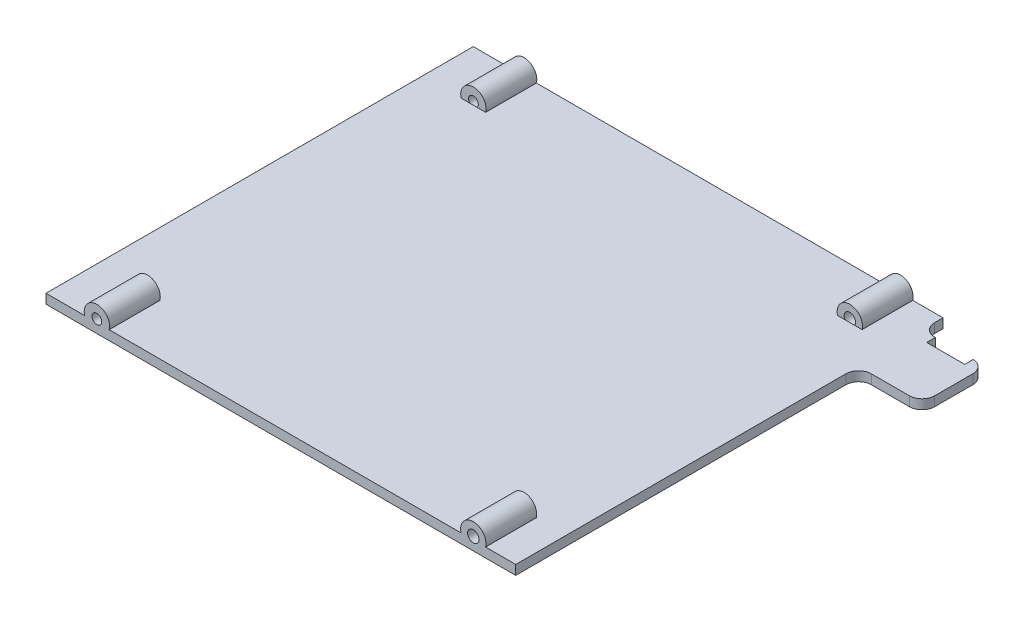
ISO-10303-21;
HEADER;
FILE_DESCRIPTION(('STEP AP214'),'2;1');
FILE_NAME('part.step','',(''),(''),'','','');
FILE_SCHEMA(('AUTOMOTIVE_DESIGN { 1 0 10303 214 1 1 1 1 }'));
ENDSEC;
DATA;
#1=APPLICATION_CONTEXT('core data for automotive mechanical design processes');
#2=APPLICATION_PROTOCOL_DEFINITION('international standard','automotive_design',2000,#1);
#3=PRODUCT_CONTEXT('',#1,'mechanical');
#4=PRODUCT('Part','Part','',(#3));
#5=PRODUCT_RELATED_PRODUCT_CATEGORY('part','',(#4));
#6=PRODUCT_DEFINITION_FORMATION('','',#4);
#7=PRODUCT_DEFINITION_CONTEXT('part definition',#1,'design');
#8=PRODUCT_DEFINITION('design','',#6,#7);
#9=PRODUCT_DEFINITION_SHAPE('','',#8);
#10=(LENGTH_UNIT() NAMED_UNIT(*) SI_UNIT(.MILLI.,.METRE.));
#11=(NAMED_UNIT(*) PLANE_ANGLE_UNIT() SI_UNIT($,.RADIAN.));
#12=(NAMED_UNIT(*) SI_UNIT($,.STERADIAN.) SOLID_ANGLE_UNIT());
#13=UNCERTAINTY_MEASURE_WITH_UNIT(LENGTH_MEASURE(1.E-05),#10,'distance_accuracy_value','');
#14=(GEOMETRIC_REPRESENTATION_CONTEXT(3) GLOBAL_UNCERTAINTY_ASSIGNED_CONTEXT((#13)) GLOBAL_UNIT_ASSIGNED_CONTEXT((#10,
#11,#12)) REPRESENTATION_CONTEXT('',''));
#15=CARTESIAN_POINT('',(0.,0.,0.));
#16=DIRECTION('',(0.,0.,1.));
#17=DIRECTION('',(1.,0.,0.));
#18=AXIS2_PLACEMENT_3D('',#15,#16,#17);
#19=CARTESIAN_POINT('',(-85.5905303741347,-18.8675075749451,-141.47256301662));
#20=DIRECTION('',(-1.,0.,0.));
#21=DIRECTION('',(0.,-1.,0.));
#22=AXIS2_PLACEMENT_3D('',#19,#20,#21);
#23=PLANE('',#22);
#24=DIRECTION('',(0.,0.999999944421006,0.000333403637407651));
#25=VECTOR('',#24,1.);
#26=CARTESIAN_POINT('',(-85.5905303741347,-20.3675075749451,-52.0805001054825));
#27=LINE('',#26,#25);
#28=CARTESIAN_POINT('',(-85.5905303741347,-20.3675075749451,-52.0805001054825));
#29=VERTEX_POINT('',#28);
#30=CARTESIAN_POINT('',(-85.5905303741347,-18.8675075749451,-52.0799999999986));
#31=VERTEX_POINT('',#30);
#32=EDGE_CURVE('E253',#29,#31,#27,.T.);
#33=ORIENTED_EDGE('',*,*,#32,.T.);
#34=DIRECTION('',(0.,0.,1.));
#35=VECTOR('',#34,1.);
#36=CARTESIAN_POINT('',(-85.5905303741347,-18.8675075749451,-141.47256301662));
#37=LINE('',#36,#35);
#38=CARTESIAN_POINT('',(-85.5905303741347,-18.8675075749451,0.));
#39=VERTEX_POINT('',#38);
#40=EDGE_CURVE('E387',#31,#39,#37,.T.);
#41=ORIENTED_EDGE('',*,*,#40,.T.);
#42=DIRECTION('',(0.,1.,0.));
#43=VECTOR('',#42,1.);
#44=CARTESIAN_POINT('',(-85.5905303741347,-18.8675075749451,0.));
#45=LINE('',#44,#43);
#46=CARTESIAN_POINT('',(-85.5905303741347,-20.3675075749451,0.));
#47=VERTEX_POINT('',#46);
#48=EDGE_CURVE('E384',#47,#39,#45,.T.);
#49=ORIENTED_EDGE('',*,*,#48,.F.);
#50=DIRECTION('',(0.,0.,1.));
#51=VECTOR('',#50,1.);
#52=CARTESIAN_POINT('',(-85.5905303741347,-20.3675075749451,-141.47256301662));
#53=LINE('',#52,#51);
#54=EDGE_CURVE('E391',#29,#47,#53,.T.);
#55=ORIENTED_EDGE('',*,*,#54,.F.);
#56=EDGE_LOOP('',(#33,#41,#49,#55));
#57=FACE_BOUND('',#56,.T.);
#58=ADVANCED_FACE('F41',(#57),#23,.F.);
#59=CARTESIAN_POINT('',(-159.667908124511,-18.8675075749451,-141.47256301662));
#60=DIRECTION('',(0.,-1.,0.));
#61=DIRECTION('',(1.,0.,0.));
#62=AXIS2_PLACEMENT_3D('',#59,#60,#61);
#63=PLANE('',#62);
#64=DIRECTION('',(1.,0.,0.));
#65=VECTOR('',#64,1.);
#66=CARTESIAN_POINT('',(-159.667908124511,-18.8675075749451,-62.7311529803631));
#67=LINE('',#66,#65);
#68=CARTESIAN_POINT('',(-83.4954652130825,-18.8675075749451,-62.7311529803631));
#69=VERTEX_POINT('',#68);
#70=CARTESIAN_POINT('',(-77.5092926086521,-18.8675075749451,-62.7311529803631));
#71=VERTEX_POINT('',#70);
#72=EDGE_CURVE('E251',#69,#71,#67,.T.);
#73=ORIENTED_EDGE('',*,*,#72,.F.);
#74=DIRECTION('',(0.,0.,1.));
#75=VECTOR('',#74,1.);
#76=CARTESIAN_POINT('',(-83.4954652130825,-18.8675075749451,-141.47256301662));
#77=LINE('',#76,#75);
#78=CARTESIAN_POINT('',(-83.4954652130825,-18.8675075749449,-64.0799999999986));
#79=VERTEX_POINT('',#78);
#80=EDGE_CURVE('E227',#79,#69,#77,.T.);
#81=ORIENTED_EDGE('',*,*,#80,.F.);
#82=DIRECTION('',(-1.,0.,0.));
#83=VECTOR('',#82,1.);
#84=CARTESIAN_POINT('',(-33.1479999999989,-18.8675075749446,-64.0799999999986));
#85=LINE('',#84,#83);
#86=CARTESIAN_POINT('',(-83.5905303741347,-18.8675075749451,-64.0799999999986));
#87=VERTEX_POINT('',#86);
#88=EDGE_CURVE('E270',#79,#87,#85,.T.);
#89=ORIENTED_EDGE('',*,*,#88,.T.);
#90=CARTESIAN_POINT('',(-83.5905303741347,-18.8675075749451,-66.0799999999986));
#91=DIRECTION('',(0.,1.,0.));
#92=DIRECTION('',(1.,0.,0.));
#93=AXIS2_PLACEMENT_3D('',#90,#91,#92);
#94=CIRCLE('',#93,2.);
#95=CARTESIAN_POINT('',(-85.5905303741347,-18.8675075749451,-66.0799999999986));
#96=VERTEX_POINT('',#95);
#97=EDGE_CURVE('E278',#96,#87,#94,.T.);
#98=ORIENTED_EDGE('',*,*,#97,.F.);
#99=CARTESIAN_POINT('',(-85.5905303741347,-18.8675075749451,-67.3799999999986));
#100=VERTEX_POINT('',#99);
#101=EDGE_CURVE('E406',#100,#96,#37,.T.);
#102=ORIENTED_EDGE('',*,*,#101,.F.);
#103=DIRECTION('',(-1.,0.,0.));
#104=VECTOR('',#103,1.);
#105=CARTESIAN_POINT('',(-159.667908124511,-18.8675075749451,-67.3799999999986));
#106=LINE('',#105,#104);
#107=CARTESIAN_POINT('',(-90.3438704257038,-18.8675075749451,-67.3799999999986));
#108=VERTEX_POINT('',#107);
#109=EDGE_CURVE('E392',#100,#108,#106,.T.);
#110=ORIENTED_EDGE('',*,*,#109,.T.);
#111=DIRECTION('',(0.,0.,-1.));
#112=VECTOR('',#111,1.);
#113=CARTESIAN_POINT('',(-90.3438704257038,-18.8675075749451,-59.3799999999986));
#114=LINE('',#113,#112);
#115=CARTESIAN_POINT('',(-90.3438704257038,-18.8675075749451,-59.3799999999986));
#116=VERTEX_POINT('',#115);
#117=EDGE_CURVE('E325',#108,#116,#114,.F.);
#118=ORIENTED_EDGE('',*,*,#117,.T.);
#119=DIRECTION('',(1.,0.,0.));
#120=VECTOR('',#119,1.);
#121=CARTESIAN_POINT('',(-159.667908124511,-18.8675075749451,-59.3799999999986));
#122=LINE('',#121,#120);
#123=CARTESIAN_POINT('',(-91.5320306214525,-18.8675075749451,-59.3799999999986));
#124=VERTEX_POINT('',#123);
#125=EDGE_CURVE('E334',#124,#116,#122,.T.);
#126=ORIENTED_EDGE('',*,*,#125,.F.);
#127=CARTESIAN_POINT('',(-93.028693576163,-18.8675075749451,-59.3799999999986));
#128=VERTEX_POINT('',#127);
#129=EDGE_CURVE('E339',#128,#124,#122,.T.);
#130=ORIENTED_EDGE('',*,*,#129,.F.);
#131=CARTESIAN_POINT('',(-94.2168537719119,-18.8675075749451,-59.3799999999986));
#132=VERTEX_POINT('',#131);
#133=EDGE_CURVE('E335',#132,#128,#122,.T.);
#134=ORIENTED_EDGE('',*,*,#133,.F.);
#135=DIRECTION('',(0.,0.,-1.));
#136=VECTOR('',#135,1.);
#137=CARTESIAN_POINT('',(-94.2168537719119,-18.8675075749451,-59.3799999999986));
#138=LINE('',#137,#136);
#139=CARTESIAN_POINT('',(-94.2168537719119,-18.8675075749451,-67.3799999999986));
#140=VERTEX_POINT('',#139);
#141=EDGE_CURVE('E317',#132,#140,#138,.T.);
#142=ORIENTED_EDGE('',*,*,#141,.T.);
#143=CARTESIAN_POINT('',(-149.708016259504,-18.8675075749451,-67.3799999999985));
#144=VERTEX_POINT('',#143);
#145=EDGE_CURVE('E396',#140,#144,#106,.T.);
#146=ORIENTED_EDGE('',*,*,#145,.T.);
#147=DIRECTION('',(0.,0.,-1.));
#148=VECTOR('',#147,1.);
#149=CARTESIAN_POINT('',(-149.708016259504,-18.8675075749451,-59.3799999999986));
#150=LINE('',#149,#148);
#151=CARTESIAN_POINT('',(-149.708016259504,-18.8675075749451,-59.3799999999986));
#152=VERTEX_POINT('',#151);
#153=EDGE_CURVE('E331',#144,#152,#150,.F.);
#154=ORIENTED_EDGE('',*,*,#153,.T.);
#155=DIRECTION('',(1.,0.,0.));
#156=VECTOR('',#155,1.);
#157=CARTESIAN_POINT('',(-159.667908124511,-18.8675075749451,-59.3799999999985));
#158=LINE('',#157,#156);
#159=CARTESIAN_POINT('',(-151.059398233736,-18.8675075749451,-59.3799999999986));
#160=VERTEX_POINT('',#159);
#161=EDGE_CURVE('E338',#160,#152,#158,.T.);
#162=ORIENTED_EDGE('',*,*,#161,.F.);
#163=CARTESIAN_POINT('',(-152.22961763148,-18.8675075749451,-59.3799999999986));
#164=VERTEX_POINT('',#163);
#165=EDGE_CURVE('E344',#164,#160,#158,.T.);
#166=ORIENTED_EDGE('',*,*,#165,.F.);
#167=CARTESIAN_POINT('',(-153.580999605713,-18.8675075749451,-59.3799999999986));
#168=VERTEX_POINT('',#167);
#169=EDGE_CURVE('E340',#168,#164,#158,.T.);
#170=ORIENTED_EDGE('',*,*,#169,.F.);
#171=DIRECTION('',(0.,0.,-1.));
#172=VECTOR('',#171,1.);
#173=CARTESIAN_POINT('',(-153.580999605713,-18.8675075749451,-59.3799999999986));
#174=LINE('',#173,#172);
#175=CARTESIAN_POINT('',(-153.580999605713,-18.8675075749451,-67.3799999999986));
#176=VERTEX_POINT('',#175);
#177=EDGE_CURVE('E328',#168,#176,#174,.T.);
#178=ORIENTED_EDGE('',*,*,#177,.T.);
#179=CARTESIAN_POINT('',(-159.667908124511,-18.8675075749451,-67.3799999999986));
#180=VERTEX_POINT('',#179);
#181=EDGE_CURVE('E397',#176,#180,#106,.T.);
#182=ORIENTED_EDGE('',*,*,#181,.T.);
#183=DIRECTION('',(0.,0.,1.));
#184=VECTOR('',#183,1.);
#185=CARTESIAN_POINT('',(-159.667908124511,-18.8675075749451,-141.47256301662));
#186=LINE('',#185,#184);
#187=CARTESIAN_POINT('',(-159.667908124511,-18.8675075749451,0.));
#188=VERTEX_POINT('',#187);
#189=EDGE_CURVE('E378',#180,#188,#186,.T.);
#190=ORIENTED_EDGE('',*,*,#189,.T.);
#191=DIRECTION('',(-1.,0.,0.));
#192=VECTOR('',#191,1.);
#193=CARTESIAN_POINT('',(-159.667908124511,-18.8675075749451,0.));
#194=LINE('',#193,#192);
#195=CARTESIAN_POINT('',(-153.580999605712,-18.8675075749451,0.));
#196=VERTEX_POINT('',#195);
#197=EDGE_CURVE('E383',#196,#188,#194,.T.);
#198=ORIENTED_EDGE('',*,*,#197,.F.);
#199=DIRECTION('',(0.,0.,1.));
#200=VECTOR('',#199,1.);
#201=CARTESIAN_POINT('',(-153.580999605712,-18.8675075749451,-8.));
#202=LINE('',#201,#200);
#203=CARTESIAN_POINT('',(-153.580999605712,-18.8675075749451,-8.));
#204=VERTEX_POINT('',#203);
#205=EDGE_CURVE('E371',#196,#204,#202,.F.);
#206=ORIENTED_EDGE('',*,*,#205,.T.);
#207=DIRECTION('',(-1.,0.,0.));
#208=VECTOR('',#207,1.);
#209=CARTESIAN_POINT('',(-159.667908124511,-18.8675075749451,-8.00000000000001));
#210=LINE('',#209,#208);
#211=CARTESIAN_POINT('',(-152.22961763148,-18.8675075749451,-8.));
#212=VERTEX_POINT('',#211);
#213=EDGE_CURVE('E416',#212,#204,#210,.T.);
#214=ORIENTED_EDGE('',*,*,#213,.F.);
#215=CARTESIAN_POINT('',(-151.059398233736,-18.8675075749451,-8.));
#216=VERTEX_POINT('',#215);
#217=EDGE_CURVE('E422',#216,#212,#210,.T.);
#218=ORIENTED_EDGE('',*,*,#217,.F.);
#219=CARTESIAN_POINT('',(-149.708016259504,-18.8675075749451,-8.));
#220=VERTEX_POINT('',#219);
#221=EDGE_CURVE('E418',#220,#216,#210,.T.);
#222=ORIENTED_EDGE('',*,*,#221,.F.);
#223=DIRECTION('',(0.,0.,1.));
#224=VECTOR('',#223,1.);
#225=CARTESIAN_POINT('',(-149.708016259504,-18.8675075749451,-8.));
#226=LINE('',#225,#224);
#227=CARTESIAN_POINT('',(-149.708016259504,-18.8675075749451,0.));
#228=VERTEX_POINT('',#227);
#229=EDGE_CURVE('E368',#220,#228,#226,.T.);
#230=ORIENTED_EDGE('',*,*,#229,.T.);
#231=CARTESIAN_POINT('',(-94.2168537719112,-18.8675075749451,0.));
#232=VERTEX_POINT('',#231);
#233=EDGE_CURVE('E382',#232,#228,#194,.T.);
#234=ORIENTED_EDGE('',*,*,#233,.F.);
#235=DIRECTION('',(0.,0.,1.));
#236=VECTOR('',#235,1.);
#237=CARTESIAN_POINT('',(-94.2168537719112,-18.8675075749451,-8.));
#238=LINE('',#237,#236);
#239=CARTESIAN_POINT('',(-94.2168537719112,-18.8675075749451,-8.));
#240=VERTEX_POINT('',#239);
#241=EDGE_CURVE('E365',#232,#240,#238,.F.);
#242=ORIENTED_EDGE('',*,*,#241,.T.);
#243=DIRECTION('',(-1.,0.,0.));
#244=VECTOR('',#243,1.);
#245=CARTESIAN_POINT('',(-159.667908124511,-18.8675075749451,-8.00000000000001));
#246=LINE('',#245,#244);
#247=CARTESIAN_POINT('',(-93.0286935761624,-18.8675075749451,-8.));
#248=VERTEX_POINT('',#247);
#249=EDGE_CURVE('E395',#248,#240,#246,.T.);
#250=ORIENTED_EDGE('',*,*,#249,.F.);
#251=CARTESIAN_POINT('',(-91.5320306214526,-18.8675075749451,-8.));
#252=VERTEX_POINT('',#251);
#253=EDGE_CURVE('E417',#252,#248,#246,.T.);
#254=ORIENTED_EDGE('',*,*,#253,.F.);
#255=CARTESIAN_POINT('',(-90.3438704257039,-18.8675075749451,-8.));
#256=VERTEX_POINT('',#255);
#257=EDGE_CURVE('E413',#256,#252,#246,.T.);
#258=ORIENTED_EDGE('',*,*,#257,.F.);
#259=DIRECTION('',(0.,0.,1.));
#260=VECTOR('',#259,1.);
#261=CARTESIAN_POINT('',(-90.3438704257039,-18.8675075749451,-8.));
#262=LINE('',#261,#260);
#263=CARTESIAN_POINT('',(-90.3438704257039,-18.8675075749451,0.));
#264=VERTEX_POINT('',#263);
#265=EDGE_CURVE('E357',#256,#264,#262,.T.);
#266=ORIENTED_EDGE('',*,*,#265,.T.);
#267=EDGE_CURVE('E379',#39,#264,#194,.T.);
#268=ORIENTED_EDGE('',*,*,#267,.F.);
#269=ORIENTED_EDGE('',*,*,#40,.F.);
#270=CARTESIAN_POINT('',(-83.5905303741347,-18.8675075749451,-52.0799999999986));
#271=DIRECTION('',(0.,1.,0.));
#272=DIRECTION('',(1.,0.,0.));
#273=AXIS2_PLACEMENT_3D('',#270,#271,#272);
#274=CIRCLE('',#273,2.);
#275=CARTESIAN_POINT('',(-83.5905303741347,-18.8675075749451,-54.0799999999986));
#276=VERTEX_POINT('',#275);
#277=EDGE_CURVE('E63',#276,#31,#274,.T.);
#278=ORIENTED_EDGE('',*,*,#277,.F.);
#279=DIRECTION('',(1.,0.,0.));
#280=VECTOR('',#279,1.);
#281=CARTESIAN_POINT('',(-33.1479999999989,-18.8675075749446,-54.0799999999986));
#282=LINE('',#281,#280);
#283=CARTESIAN_POINT('',(-77.5905303741347,-18.867507574945,-54.0799999999986));
#284=VERTEX_POINT('',#283);
#285=EDGE_CURVE('E258',#276,#284,#282,.T.);
#286=ORIENTED_EDGE('',*,*,#285,.T.);
#287=CARTESIAN_POINT('',(-77.5905303741347,-18.867507574945,-56.0799999999986));
#288=DIRECTION('',(0.,1.,0.));
#289=DIRECTION('',(1.,0.,0.));
#290=AXIS2_PLACEMENT_3D('',#287,#288,#289);
#291=CIRCLE('',#290,2.);
#292=CARTESIAN_POINT('',(-75.5905303741347,-18.867507574945,-56.0799999999986));
#293=VERTEX_POINT('',#292);
#294=EDGE_CURVE('E261',#284,#293,#291,.T.);
#295=ORIENTED_EDGE('',*,*,#294,.T.);
#296=DIRECTION('',(0.,0.,-1.));
#297=VECTOR('',#296,1.);
#298=CARTESIAN_POINT('',(-75.5905303741347,-18.867507574945,-52.0799999999985));
#299=LINE('',#298,#297);
#300=CARTESIAN_POINT('',(-75.5905303741347,-18.867507574945,-62.0799999999986));
#301=VERTEX_POINT('',#300);
#302=EDGE_CURVE('E264',#293,#301,#299,.T.);
#303=ORIENTED_EDGE('',*,*,#302,.T.);
#304=CARTESIAN_POINT('',(-77.5905303741347,-18.867507574945,-62.0799999999986));
#305=DIRECTION('',(0.,1.,0.));
#306=DIRECTION('',(1.,0.,0.));
#307=AXIS2_PLACEMENT_3D('',#304,#305,#306);
#308=CIRCLE('',#307,2.);
#309=CARTESIAN_POINT('',(-77.5092926086521,-18.8675075749449,-64.0783494252642));
#310=VERTEX_POINT('',#309);
#311=EDGE_CURVE('E267',#301,#310,#308,.T.);
#312=ORIENTED_EDGE('',*,*,#311,.T.);
#313=DIRECTION('',(0.,0.,-1.));
#314=VECTOR('',#313,1.);
#315=CARTESIAN_POINT('',(-77.5092926086521,-18.8675075749451,-141.47256301662));
#316=LINE('',#315,#314);
#317=EDGE_CURVE('E247',#71,#310,#316,.T.);
#318=ORIENTED_EDGE('',*,*,#317,.F.);
#319=EDGE_LOOP('',(#73,#81,#89,#98,#102,#110,#118,#126,#130,#134,#142,#146,#154,#162,#166,#170,
#178,#182,#190,#198,#206,#214,#218,#222,#230,#234,#242,#250,#254,#258,#266,#268,#269,#278,#286,
#295,#303,#312,#318));
#320=FACE_BOUND('',#319,.T.);
#321=ADVANCED_FACE('F440',(#320),#63,.F.);
#322=CARTESIAN_POINT('',(-85.5905303741347,-20.3675075749451,-141.47256301662));
#323=DIRECTION('',(0.,1.,0.));
#324=DIRECTION('',(-1.,0.,0.));
#325=AXIS2_PLACEMENT_3D('',#322,#323,#324);
#326=PLANE('',#325);
#327=CARTESIAN_POINT('',(-77.5905303741347,-20.3675075749451,-62.0799999999986));
#328=DIRECTION('',(0.,-1.,0.));
#329=DIRECTION('',(-1.,0.,0.));
#330=AXIS2_PLACEMENT_3D('',#327,#328,#329);
#331=CIRCLE('',#330,2.);
#332=CARTESIAN_POINT('',(-77.5092926086521,-20.3675075749451,-64.0783494252642));
#333=VERTEX_POINT('',#332);
#334=CARTESIAN_POINT('',(-75.5905303741347,-20.3675075749451,-62.0799999999986));
#335=VERTEX_POINT('',#334);
#336=EDGE_CURVE('E284',#333,#335,#331,.T.);
#337=ORIENTED_EDGE('',*,*,#336,.T.);
#338=DIRECTION('',(0.,0.,1.));
#339=VECTOR('',#338,1.);
#340=CARTESIAN_POINT('',(-75.5905303741347,-20.3675075749451,-64.0799999999986));
#341=LINE('',#340,#339);
#342=CARTESIAN_POINT('',(-75.5905303741347,-20.3675075749451,-56.0799999999986));
#343=VERTEX_POINT('',#342);
#344=EDGE_CURVE('E286',#335,#343,#341,.T.);
#345=ORIENTED_EDGE('',*,*,#344,.T.);
#346=CARTESIAN_POINT('',(-77.5905303741347,-20.3675075749451,-56.0799999999986));
#347=DIRECTION('',(0.,-1.,0.));
#348=DIRECTION('',(-1.,0.,0.));
#349=AXIS2_PLACEMENT_3D('',#346,#347,#348);
#350=CIRCLE('',#349,2.);
#351=CARTESIAN_POINT('',(-77.5905303741347,-20.3675075749451,-54.0799999999986));
#352=VERTEX_POINT('',#351);
#353=EDGE_CURVE('E273',#343,#352,#350,.T.);
#354=ORIENTED_EDGE('',*,*,#353,.T.);
#355=DIRECTION('',(-1.,0.,0.));
#356=VECTOR('',#355,1.);
#357=CARTESIAN_POINT('',(-75.5905303741347,-20.3675075749451,-54.0799999999986));
#358=LINE('',#357,#356);
#359=CARTESIAN_POINT('',(-83.5905303741347,-20.3675075749451,-54.0799999999986));
#360=VERTEX_POINT('',#359);
#361=EDGE_CURVE('E277',#352,#360,#358,.T.);
#362=ORIENTED_EDGE('',*,*,#361,.T.);
#363=CARTESIAN_POINT('',(-83.5905303741347,-20.3675075749451,-52.0799999999986));
#364=DIRECTION('',(0.,-1.,0.));
#365=DIRECTION('',(-1.,0.,0.));
#366=AXIS2_PLACEMENT_3D('',#363,#364,#365);
#367=CIRCLE('',#366,2.);
#368=EDGE_CURVE('E274',#29,#360,#367,.T.);
#369=ORIENTED_EDGE('',*,*,#368,.F.);
#370=ORIENTED_EDGE('',*,*,#54,.T.);
#371=DIRECTION('',(1.,0.,0.));
#372=VECTOR('',#371,1.);
#373=CARTESIAN_POINT('',(-85.5905303741347,-20.3675075749451,0.));
#374=LINE('',#373,#372);
#375=CARTESIAN_POINT('',(-159.667908124511,-20.3675075749451,0.));
#376=VERTEX_POINT('',#375);
#377=EDGE_CURVE('E389',#376,#47,#374,.T.);
#378=ORIENTED_EDGE('',*,*,#377,.F.);
#379=DIRECTION('',(0.,0.,1.));
#380=VECTOR('',#379,1.);
#381=CARTESIAN_POINT('',(-159.667908124511,-20.3675075749451,-141.47256301662));
#382=LINE('',#381,#380);
#383=CARTESIAN_POINT('',(-159.667908124511,-20.3675075749451,-67.3799999999986));
#384=VERTEX_POINT('',#383);
#385=EDGE_CURVE('E374',#384,#376,#382,.T.);
#386=ORIENTED_EDGE('',*,*,#385,.F.);
#387=DIRECTION('',(1.,0.,0.));
#388=VECTOR('',#387,1.);
#389=CARTESIAN_POINT('',(-85.5905303741347,-20.3675075749451,-67.3799999999986));
#390=LINE('',#389,#388);
#391=CARTESIAN_POINT('',(-85.5905303741347,-20.3675075749451,-67.3799999999986));
#392=VERTEX_POINT('',#391);
#393=EDGE_CURVE('E400',#384,#392,#390,.T.);
#394=ORIENTED_EDGE('',*,*,#393,.T.);
#395=CARTESIAN_POINT('',(-85.5905303741347,-20.3675075749451,-66.0799999999986));
#396=VERTEX_POINT('',#395);
#397=EDGE_CURVE('E388',#392,#396,#53,.T.);
#398=ORIENTED_EDGE('',*,*,#397,.T.);
#399=CARTESIAN_POINT('',(-83.5905303741347,-20.3675075749451,-66.0799999999986));
#400=DIRECTION('',(0.,-1.,0.));
#401=DIRECTION('',(-1.,0.,0.));
#402=AXIS2_PLACEMENT_3D('',#399,#400,#401);
#403=CIRCLE('',#402,2.);
#404=CARTESIAN_POINT('',(-83.5905303741347,-20.3675075749451,-64.0799999999986));
#405=VERTEX_POINT('',#404);
#406=EDGE_CURVE('E281',#396,#405,#403,.F.);
#407=ORIENTED_EDGE('',*,*,#406,.T.);
#408=DIRECTION('',(1.,0.,0.));
#409=VECTOR('',#408,1.);
#410=CARTESIAN_POINT('',(-85.5905303741346,-20.3675075749451,-64.0799999999986));
#411=LINE('',#410,#409);
#412=CARTESIAN_POINT('',(-83.4954652130825,-20.3675075749454,-64.0799999999986));
#413=VERTEX_POINT('',#412);
#414=EDGE_CURVE('E243',#405,#413,#411,.T.);
#415=ORIENTED_EDGE('',*,*,#414,.T.);
#416=DIRECTION('',(0.,0.,1.));
#417=VECTOR('',#416,1.);
#418=CARTESIAN_POINT('',(-83.4954652130825,-20.3675075749454,-66.6522392252637));
#419=LINE('',#418,#417);
#420=CARTESIAN_POINT('',(-83.4954652130825,-20.3675075749454,-62.7311529803631));
#421=VERTEX_POINT('',#420);
#422=EDGE_CURVE('E224',#413,#421,#419,.T.);
#423=ORIENTED_EDGE('',*,*,#422,.T.);
#424=DIRECTION('',(1.,0.,0.));
#425=VECTOR('',#424,1.);
#426=CARTESIAN_POINT('',(-83.4954652130825,-20.3675075749454,-62.7311529803631));
#427=LINE('',#426,#425);
#428=CARTESIAN_POINT('',(-77.5092926086521,-20.3675075749454,-62.7311529803631));
#429=VERTEX_POINT('',#428);
#430=EDGE_CURVE('E235',#421,#429,#427,.T.);
#431=ORIENTED_EDGE('',*,*,#430,.T.);
#432=DIRECTION('',(0.,0.,-1.));
#433=VECTOR('',#432,1.);
#434=CARTESIAN_POINT('',(-77.5092926086521,-20.3675075749454,-62.7311529803631));
#435=LINE('',#434,#433);
#436=EDGE_CURVE('E232',#429,#333,#435,.T.);
#437=ORIENTED_EDGE('',*,*,#436,.T.);
#438=EDGE_LOOP('',(#337,#345,#354,#362,#369,#370,#378,#386,#394,#398,#407,#415,#423,#431,#437));
#439=FACE_BOUND('',#438,.T.);
#440=ADVANCED_FACE('F240',(#439),#326,.F.);
#441=ORIENTED_EDGE('',*,*,#397,.F.);
#442=DIRECTION('',(0.,1.,0.));
#443=VECTOR('',#442,1.);
#444=CARTESIAN_POINT('',(-85.5905303741347,-18.867507574945,-67.3799999999986));
#445=LINE('',#444,#443);
#446=EDGE_CURVE('E398',#392,#100,#445,.T.);
#447=ORIENTED_EDGE('',*,*,#446,.T.);
#448=ORIENTED_EDGE('',*,*,#101,.T.);
#449=DIRECTION('',(0.,1.,0.));
#450=VECTOR('',#449,1.);
#451=CARTESIAN_POINT('',(-85.5905303741347,19.6324924250548,-66.0799999999986));
#452=LINE('',#451,#450);
#453=EDGE_CURVE('E257',#96,#396,#452,.F.);
#454=ORIENTED_EDGE('',*,*,#453,.T.);
#455=EDGE_LOOP('',(#441,#447,#448,#454));
#456=FACE_BOUND('',#455,.T.);
#457=ADVANCED_FACE('F475',(#456),#23,.F.);
#458=CARTESIAN_POINT('',(-159.667908124511,-20.3675075749451,-141.47256301662));
#459=DIRECTION('',(1.,0.,0.));
#460=DIRECTION('',(0.,0.,1.));
#461=AXIS2_PLACEMENT_3D('',#458,#459,#460);
#462=PLANE('',#461);
#463=DIRECTION('',(0.,-1.,0.));
#464=VECTOR('',#463,1.);
#465=CARTESIAN_POINT('',(-159.667908124511,-20.367507574945,-67.3799999999986));
#466=LINE('',#465,#464);
#467=EDGE_CURVE('E377',#180,#384,#466,.T.);
#468=ORIENTED_EDGE('',*,*,#467,.T.);
#469=ORIENTED_EDGE('',*,*,#385,.T.);
#470=DIRECTION('',(0.,-1.,0.));
#471=VECTOR('',#470,1.);
#472=CARTESIAN_POINT('',(-159.667908124511,-20.3675075749451,0.));
#473=LINE('',#472,#471);
#474=EDGE_CURVE('E375',#188,#376,#473,.T.);
#475=ORIENTED_EDGE('',*,*,#474,.F.);
#476=ORIENTED_EDGE('',*,*,#189,.F.);
#477=EDGE_LOOP('',(#468,#469,#475,#476));
#478=FACE_BOUND('',#477,.T.);
#479=ADVANCED_FACE('F466',(#478),#462,.F.);
#480=CARTESIAN_POINT('',(0.,0.,0.));
#481=DIRECTION('',(0.,0.,1.));
#482=DIRECTION('',(-1.,0.,0.));
#483=AXIS2_PLACEMENT_3D('',#480,#481,#482);
#484=PLANE('',#483);
#485=CARTESIAN_POINT('',(-151.644507932608,-18.3675075749456,0.));
#486=DIRECTION('',(0.,0.,-1.));
#487=DIRECTION('',(-1.,0.,0.));
#488=AXIS2_PLACEMENT_3D('',#485,#486,#487);
#489=CIRCLE('',#488,0.769644956920995);
#490=CARTESIAN_POINT('',(-152.414152889529,-18.3675075749456,0.));
#491=VERTEX_POINT('',#490);
#492=EDGE_CURVE('E345',#491,#491,#489,.T.);
#493=ORIENTED_EDGE('',*,*,#492,.T.);
#494=EDGE_LOOP('',(#493));
#495=FACE_BOUND('',#494,.T.);
#496=CARTESIAN_POINT('',(-92.2803620988075,-18.3675075749452,0.));
#497=DIRECTION('',(0.,0.,-1.));
#498=DIRECTION('',(-1.,0.,0.));
#499=AXIS2_PLACEMENT_3D('',#496,#497,#498);
#500=CIRCLE('',#499,0.900000000000003);
#501=CARTESIAN_POINT('',(-93.1803620988075,-18.3675075749452,0.));
#502=VERTEX_POINT('',#501);
#503=EDGE_CURVE('E349',#502,#502,#500,.T.);
#504=ORIENTED_EDGE('',*,*,#503,.T.);
#505=EDGE_LOOP('',(#504));
#506=FACE_BOUND('',#505,.T.);
#507=ORIENTED_EDGE('',*,*,#48,.T.);
#508=ORIENTED_EDGE('',*,*,#267,.T.);
#509=CARTESIAN_POINT('',(-92.2803620988075,-18.3675075749452,0.));
#510=DIRECTION('',(0.,0.,1.));
#511=DIRECTION('',(1.,0.,0.));
#512=AXIS2_PLACEMENT_3D('',#509,#510,#511);
#513=CIRCLE('',#512,1.99999999999992);
#514=EDGE_CURVE('E360',#264,#232,#513,.T.);
#515=ORIENTED_EDGE('',*,*,#514,.T.);
#516=ORIENTED_EDGE('',*,*,#233,.T.);
#517=CARTESIAN_POINT('',(-151.644507932608,-18.3675075749453,0.));
#518=DIRECTION('',(0.,0.,1.));
#519=DIRECTION('',(1.,0.,0.));
#520=AXIS2_PLACEMENT_3D('',#517,#518,#519);
#521=CIRCLE('',#520,2.00000000000008);
#522=EDGE_CURVE('E358',#228,#196,#521,.T.);
#523=ORIENTED_EDGE('',*,*,#522,.T.);
#524=ORIENTED_EDGE('',*,*,#197,.T.);
#525=ORIENTED_EDGE('',*,*,#474,.T.);
#526=ORIENTED_EDGE('',*,*,#377,.T.);
#527=EDGE_LOOP('',(#507,#508,#515,#516,#523,#524,#525,#526));
#528=FACE_BOUND('',#527,.T.);
#529=ADVANCED_FACE('F461',(#495,#506,#528),#484,.T.);
#530=CARTESIAN_POINT('',(-53.1500000000001,-0.367507574945579,-67.3799999999986));
#531=DIRECTION('',(0.,0.,-1.));
#532=DIRECTION('',(0.999885624174656,-0.015124105555629,0.));
#533=AXIS2_PLACEMENT_3D('',#530,#531,#532);
#534=PLANE('',#533);
#535=CARTESIAN_POINT('',(-92.2803620988078,-18.3675075749455,-67.3799999999986));
#536=DIRECTION('',(0.,0.,-1.));
#537=DIRECTION('',(0.,1.,0.));
#538=AXIS2_PLACEMENT_3D('',#535,#536,#537);
#539=CIRCLE('',#538,0.900000000000158);
#540=CARTESIAN_POINT('',(-92.2803620988078,-17.4675075749454,-67.3799999999986));
#541=VERTEX_POINT('',#540);
#542=EDGE_CURVE('E305',#541,#541,#539,.T.);
#543=ORIENTED_EDGE('',*,*,#542,.F.);
#544=EDGE_LOOP('',(#543));
#545=FACE_BOUND('',#544,.T.);
#546=CARTESIAN_POINT('',(-151.644507932608,-18.3675075749455,-67.3799999999985));
#547=DIRECTION('',(0.,0.,-1.));
#548=DIRECTION('',(0.,1.,0.));
#549=AXIS2_PLACEMENT_3D('',#546,#547,#548);
#550=CIRCLE('',#549,0.769644956920995);
#551=CARTESIAN_POINT('',(-151.644507932608,-17.5978626180245,-67.3799999999985));
#552=VERTEX_POINT('',#551);
#553=EDGE_CURVE('E293',#552,#552,#550,.T.);
#554=ORIENTED_EDGE('',*,*,#553,.F.);
#555=EDGE_LOOP('',(#554));
#556=FACE_BOUND('',#555,.T.);
#557=ORIENTED_EDGE('',*,*,#109,.F.);
#558=ORIENTED_EDGE('',*,*,#446,.F.);
#559=ORIENTED_EDGE('',*,*,#393,.F.);
#560=ORIENTED_EDGE('',*,*,#467,.F.);
#561=ORIENTED_EDGE('',*,*,#181,.F.);
#562=CARTESIAN_POINT('',(-151.644507932608,-18.3675075749456,-67.3799999999985));
#563=DIRECTION('',(0.,0.,-1.));
#564=DIRECTION('',(0.,1.,0.));
#565=AXIS2_PLACEMENT_3D('',#562,#563,#564);
#566=CIRCLE('',#565,2.00000000000039);
#567=EDGE_CURVE('E318',#176,#144,#566,.T.);
#568=ORIENTED_EDGE('',*,*,#567,.T.);
#569=ORIENTED_EDGE('',*,*,#145,.F.);
#570=CARTESIAN_POINT('',(-92.2803620988079,-18.3675075749456,-67.3799999999986));
#571=DIRECTION('',(0.,0.,-1.));
#572=DIRECTION('',(0.,1.,0.));
#573=AXIS2_PLACEMENT_3D('',#570,#571,#572);
#574=CIRCLE('',#573,2.00000000000021);
#575=EDGE_CURVE('E320',#140,#108,#574,.T.);
#576=ORIENTED_EDGE('',*,*,#575,.T.);
#577=EDGE_LOOP('',(#557,#558,#559,#560,#561,#568,#569,#576));
#578=FACE_BOUND('',#577,.T.);
#579=ADVANCED_FACE('F43',(#545,#556,#578),#534,.T.);
#580=CARTESIAN_POINT('',(-92.2803620988075,-18.3675075749452,-8.));
#581=DIRECTION('',(0.,0.,-1.));
#582=DIRECTION('',(1.,0.,0.));
#583=AXIS2_PLACEMENT_3D('',#580,#581,#582);
#584=PLANE('',#583);
#585=CARTESIAN_POINT('',(-92.2803620988075,-18.3675075749452,-8.));
#586=DIRECTION('',(0.,0.,1.));
#587=DIRECTION('',(1.,0.,0.));
#588=AXIS2_PLACEMENT_3D('',#585,#586,#587);
#589=CIRCLE('',#588,0.900000000000003);
#590=EDGE_CURVE('E425',#252,#248,#589,.T.);
#591=ORIENTED_EDGE('',*,*,#590,.T.);
#592=ORIENTED_EDGE('',*,*,#249,.T.);
#593=CARTESIAN_POINT('',(-92.2803620988075,-18.3675075749452,-8.));
#594=DIRECTION('',(0.,0.,1.));
#595=DIRECTION('',(1.,0.,0.));
#596=AXIS2_PLACEMENT_3D('',#593,#594,#595);
#597=CIRCLE('',#596,1.99999999999992);
#598=EDGE_CURVE('E351',#256,#240,#597,.T.);
#599=ORIENTED_EDGE('',*,*,#598,.F.);
#600=ORIENTED_EDGE('',*,*,#257,.T.);
#601=EDGE_LOOP('',(#591,#592,#599,#600));
#602=FACE_BOUND('',#601,.T.);
#603=ADVANCED_FACE('F717',(#602),#584,.T.);
#604=CARTESIAN_POINT('',(-92.2803620988075,-18.3675075749452,-8.));
#605=DIRECTION('',(0.,0.,1.));
#606=DIRECTION('',(-1.,0.,0.));
#607=AXIS2_PLACEMENT_3D('',#604,#605,#606);
#608=CYLINDRICAL_SURFACE('',#607,1.99999999999992);
#609=ORIENTED_EDGE('',*,*,#514,.F.);
#610=ORIENTED_EDGE('',*,*,#265,.F.);
#611=ORIENTED_EDGE('',*,*,#598,.T.);
#612=ORIENTED_EDGE('',*,*,#241,.F.);
#613=EDGE_LOOP('',(#609,#610,#611,#612));
#614=FACE_BOUND('',#613,.T.);
#615=ADVANCED_FACE('F708',(#614),#608,.T.);
#616=CARTESIAN_POINT('',(-151.644507932608,-18.3675075749453,-8.));
#617=DIRECTION('',(0.,0.,-1.));
#618=DIRECTION('',(1.,0.,0.));
#619=AXIS2_PLACEMENT_3D('',#616,#617,#618);
#620=PLANE('',#619);
#621=CARTESIAN_POINT('',(-151.644507932608,-18.3675075749456,-8.));
#622=DIRECTION('',(0.,0.,1.));
#623=DIRECTION('',(1.,0.,0.));
#624=AXIS2_PLACEMENT_3D('',#621,#622,#623);
#625=CIRCLE('',#624,0.769644956920995);
#626=EDGE_CURVE('E421',#216,#212,#625,.T.);
#627=ORIENTED_EDGE('',*,*,#626,.T.);
#628=ORIENTED_EDGE('',*,*,#213,.T.);
#629=CARTESIAN_POINT('',(-151.644507932608,-18.3675075749453,-8.));
#630=DIRECTION('',(0.,0.,1.));
#631=DIRECTION('',(1.,0.,0.));
#632=AXIS2_PLACEMENT_3D('',#629,#630,#631);
#633=CIRCLE('',#632,2.00000000000008);
#634=EDGE_CURVE('E355',#220,#204,#633,.T.);
#635=ORIENTED_EDGE('',*,*,#634,.F.);
#636=ORIENTED_EDGE('',*,*,#221,.T.);
#637=EDGE_LOOP('',(#627,#628,#635,#636));
#638=FACE_BOUND('',#637,.T.);
#639=ADVANCED_FACE('F586',(#638),#620,.T.);
#640=CARTESIAN_POINT('',(-151.644507932608,-18.3675075749453,-8.));
#641=DIRECTION('',(0.,0.,1.));
#642=DIRECTION('',(-1.,0.,0.));
#643=AXIS2_PLACEMENT_3D('',#640,#641,#642);
#644=CYLINDRICAL_SURFACE('',#643,2.00000000000008);
#645=ORIENTED_EDGE('',*,*,#522,.F.);
#646=ORIENTED_EDGE('',*,*,#229,.F.);
#647=ORIENTED_EDGE('',*,*,#634,.T.);
#648=ORIENTED_EDGE('',*,*,#205,.F.);
#649=EDGE_LOOP('',(#645,#646,#647,#648));
#650=FACE_BOUND('',#649,.T.);
#651=ADVANCED_FACE('F567',(#650),#644,.T.);
#652=CARTESIAN_POINT('',(-92.2803620988075,-18.3675075749452,-8.));
#653=DIRECTION('',(0.,0.,-1.));
#654=DIRECTION('',(1.,0.,0.));
#655=AXIS2_PLACEMENT_3D('',#652,#653,#654);
#656=PLANE('',#655);
#657=CARTESIAN_POINT('',(-151.644507932608,-18.3675075749456,-8.));
#658=DIRECTION('',(0.,0.,1.));
#659=DIRECTION('',(1.,0.,0.));
#660=AXIS2_PLACEMENT_3D('',#657,#658,#659);
#661=CIRCLE('',#660,0.769644956920995);
#662=EDGE_CURVE('E348',#216,#212,#661,.F.);
#663=ORIENTED_EDGE('',*,*,#662,.F.);
#664=ORIENTED_EDGE('',*,*,#217,.T.);
#665=EDGE_LOOP('',(#663,#664));
#666=FACE_BOUND('',#665,.T.);
#667=ADVANCED_FACE('F561',(#666),#656,.F.);
#668=CARTESIAN_POINT('',(-151.644507932608,-18.3675075749456,-10.5455844122716));
#669=DIRECTION('',(0.,0.,1.));
#670=DIRECTION('',(-1.,0.,0.));
#671=AXIS2_PLACEMENT_3D('',#668,#669,#670);
#672=CYLINDRICAL_SURFACE('',#671,0.769644956920995);
#673=ORIENTED_EDGE('',*,*,#492,.F.);
#674=EDGE_LOOP('',(#673));
#675=FACE_BOUND('',#674,.T.);
#676=ORIENTED_EDGE('',*,*,#662,.T.);
#677=ORIENTED_EDGE('',*,*,#626,.F.);
#678=EDGE_LOOP('',(#676,#677));
#679=FACE_BOUND('',#678,.T.);
#680=ADVANCED_FACE('F566',(#675,#679),#672,.F.);
#681=CARTESIAN_POINT('',(-92.2803620988075,-18.3675075749452,-8.));
#682=DIRECTION('',(0.,0.,-1.));
#683=DIRECTION('',(1.,0.,0.));
#684=AXIS2_PLACEMENT_3D('',#681,#682,#683);
#685=PLANE('',#684);
#686=CARTESIAN_POINT('',(-92.2803620988075,-18.3675075749452,-8.));
#687=DIRECTION('',(0.,0.,1.));
#688=DIRECTION('',(1.,0.,0.));
#689=AXIS2_PLACEMENT_3D('',#686,#687,#688);
#690=CIRCLE('',#689,0.900000000000003);
#691=EDGE_CURVE('E343',#252,#248,#690,.F.);
#692=ORIENTED_EDGE('',*,*,#691,.F.);
#693=ORIENTED_EDGE('',*,*,#253,.T.);
#694=EDGE_LOOP('',(#692,#693));
#695=FACE_BOUND('',#694,.T.);
#696=ADVANCED_FACE('F577',(#695),#685,.F.);
#697=CARTESIAN_POINT('',(-92.2803620988075,-18.3675075749452,-10.5455844122716));
#698=DIRECTION('',(0.,0.,1.));
#699=DIRECTION('',(-1.,0.,0.));
#700=AXIS2_PLACEMENT_3D('',#697,#698,#699);
#701=CYLINDRICAL_SURFACE('',#700,0.900000000000003);
#702=ORIENTED_EDGE('',*,*,#503,.F.);
#703=EDGE_LOOP('',(#702));
#704=FACE_BOUND('',#703,.T.);
#705=ORIENTED_EDGE('',*,*,#691,.T.);
#706=ORIENTED_EDGE('',*,*,#590,.F.);
#707=EDGE_LOOP('',(#705,#706));
#708=FACE_BOUND('',#707,.T.);
#709=ADVANCED_FACE('F765',(#704,#708),#701,.F.);
#710=CARTESIAN_POINT('',(-92.2803620988079,-18.3675075749456,-59.3799999999986));
#711=DIRECTION('',(0.,0.,1.));
#712=DIRECTION('',(0.,1.,0.));
#713=AXIS2_PLACEMENT_3D('',#710,#711,#712);
#714=PLANE('',#713);
#715=CARTESIAN_POINT('',(-92.2803620988078,-18.3675075749455,-59.3799999999986));
#716=DIRECTION('',(0.,0.,-1.));
#717=DIRECTION('',(0.,1.,0.));
#718=AXIS2_PLACEMENT_3D('',#715,#716,#717);
#719=CIRCLE('',#718,0.900000000000158);
#720=EDGE_CURVE('E431',#128,#124,#719,.T.);
#721=ORIENTED_EDGE('',*,*,#720,.T.);
#722=ORIENTED_EDGE('',*,*,#125,.T.);
#723=CARTESIAN_POINT('',(-92.2803620988079,-18.3675075749456,-59.3799999999986));
#724=DIRECTION('',(0.,0.,-1.));
#725=DIRECTION('',(0.,1.,0.));
#726=AXIS2_PLACEMENT_3D('',#723,#724,#725);
#727=CIRCLE('',#726,2.00000000000021);
#728=EDGE_CURVE('E308',#132,#116,#727,.T.);
#729=ORIENTED_EDGE('',*,*,#728,.F.);
#730=ORIENTED_EDGE('',*,*,#133,.T.);
#731=EDGE_LOOP('',(#721,#722,#729,#730));
#732=FACE_BOUND('',#731,.T.);
#733=ADVANCED_FACE('F493',(#732),#714,.T.);
#734=CARTESIAN_POINT('',(-92.2803620988079,-18.3675075749456,-59.3799999999986));
#735=DIRECTION('',(0.,0.,-1.));
#736=DIRECTION('',(0.,-1.,0.));
#737=AXIS2_PLACEMENT_3D('',#734,#735,#736);
#738=CYLINDRICAL_SURFACE('',#737,2.00000000000021);
#739=ORIENTED_EDGE('',*,*,#575,.F.);
#740=ORIENTED_EDGE('',*,*,#141,.F.);
#741=ORIENTED_EDGE('',*,*,#728,.T.);
#742=ORIENTED_EDGE('',*,*,#117,.F.);
#743=EDGE_LOOP('',(#739,#740,#741,#742));
#744=FACE_BOUND('',#743,.T.);
#745=ADVANCED_FACE('F488',(#744),#738,.T.);
#746=CARTESIAN_POINT('',(-151.644507932608,-18.3675075749456,-59.3799999999986));
#747=DIRECTION('',(0.,0.,1.));
#748=DIRECTION('',(0.,1.,0.));
#749=AXIS2_PLACEMENT_3D('',#746,#747,#748);
#750=PLANE('',#749);
#751=CARTESIAN_POINT('',(-151.644507932608,-18.3675075749455,-59.3799999999986));
#752=DIRECTION('',(0.,0.,-1.));
#753=DIRECTION('',(0.,1.,0.));
#754=AXIS2_PLACEMENT_3D('',#751,#752,#753);
#755=CIRCLE('',#754,0.769644956920995);
#756=EDGE_CURVE('E428',#164,#160,#755,.T.);
#757=ORIENTED_EDGE('',*,*,#756,.T.);
#758=ORIENTED_EDGE('',*,*,#161,.T.);
#759=CARTESIAN_POINT('',(-151.644507932608,-18.3675075749456,-59.3799999999986));
#760=DIRECTION('',(0.,0.,-1.));
#761=DIRECTION('',(0.,1.,0.));
#762=AXIS2_PLACEMENT_3D('',#759,#760,#761);
#763=CIRCLE('',#762,2.00000000000039);
#764=EDGE_CURVE('E315',#168,#152,#763,.T.);
#765=ORIENTED_EDGE('',*,*,#764,.F.);
#766=ORIENTED_EDGE('',*,*,#169,.T.);
#767=EDGE_LOOP('',(#757,#758,#765,#766));
#768=FACE_BOUND('',#767,.T.);
#769=ADVANCED_FACE('F508',(#768),#750,.T.);
#770=CARTESIAN_POINT('',(-151.644507932608,-18.3675075749456,-59.3799999999986));
#771=DIRECTION('',(0.,0.,-1.));
#772=DIRECTION('',(0.,-1.,0.));
#773=AXIS2_PLACEMENT_3D('',#770,#771,#772);
#774=CYLINDRICAL_SURFACE('',#773,2.00000000000039);
#775=ORIENTED_EDGE('',*,*,#567,.F.);
#776=ORIENTED_EDGE('',*,*,#177,.F.);
#777=ORIENTED_EDGE('',*,*,#764,.T.);
#778=ORIENTED_EDGE('',*,*,#153,.F.);
#779=EDGE_LOOP('',(#775,#776,#777,#778));
#780=FACE_BOUND('',#779,.T.);
#781=ADVANCED_FACE('F505',(#780),#774,.T.);
#782=CARTESIAN_POINT('',(-151.644507932608,-18.3675075749455,-59.3799999999986));
#783=DIRECTION('',(0.,0.,1.));
#784=DIRECTION('',(0.,1.,0.));
#785=AXIS2_PLACEMENT_3D('',#782,#783,#784);
#786=PLANE('',#785);
#787=CARTESIAN_POINT('',(-151.644507932608,-18.3675075749455,-59.3799999999986));
#788=DIRECTION('',(0.,0.,-1.));
#789=DIRECTION('',(0.,1.,0.));
#790=AXIS2_PLACEMENT_3D('',#787,#788,#789);
#791=CIRCLE('',#790,0.769644956920995);
#792=EDGE_CURVE('E311',#160,#164,#791,.T.);
#793=ORIENTED_EDGE('',*,*,#792,.T.);
#794=ORIENTED_EDGE('',*,*,#165,.T.);
#795=EDGE_LOOP('',(#793,#794));
#796=FACE_BOUND('',#795,.T.);
#797=ADVANCED_FACE('F513',(#796),#786,.F.);
#798=CARTESIAN_POINT('',(-151.644507932608,-18.3675075749455,-67.3799999999985));
#799=DIRECTION('',(0.,0.,1.));
#800=DIRECTION('',(0.,1.,0.));
#801=AXIS2_PLACEMENT_3D('',#798,#799,#800);
#802=CYLINDRICAL_SURFACE('',#801,0.769644956920995);
#803=ORIENTED_EDGE('',*,*,#553,.T.);
#804=EDGE_LOOP('',(#803));
#805=FACE_BOUND('',#804,.T.);
#806=ORIENTED_EDGE('',*,*,#792,.F.);
#807=ORIENTED_EDGE('',*,*,#756,.F.);
#808=EDGE_LOOP('',(#806,#807));
#809=FACE_BOUND('',#808,.T.);
#810=ADVANCED_FACE('F515',(#805,#809),#802,.F.);
#811=CARTESIAN_POINT('',(-92.2803620988078,-18.3675075749455,-59.3799999999986));
#812=DIRECTION('',(0.,0.,1.));
#813=DIRECTION('',(0.,1.,0.));
#814=AXIS2_PLACEMENT_3D('',#811,#812,#813);
#815=PLANE('',#814);
#816=CARTESIAN_POINT('',(-92.2803620988078,-18.3675075749455,-59.3799999999986));
#817=DIRECTION('',(0.,0.,-1.));
#818=DIRECTION('',(0.,1.,0.));
#819=AXIS2_PLACEMENT_3D('',#816,#817,#818);
#820=CIRCLE('',#819,0.900000000000158);
#821=EDGE_CURVE('E309',#124,#128,#820,.T.);
#822=ORIENTED_EDGE('',*,*,#821,.T.);
#823=ORIENTED_EDGE('',*,*,#129,.T.);
#824=EDGE_LOOP('',(#822,#823));
#825=FACE_BOUND('',#824,.T.);
#826=ADVANCED_FACE('F497',(#825),#815,.F.);
#827=CARTESIAN_POINT('',(-92.2803620988078,-18.3675075749455,-67.3799999999986));
#828=DIRECTION('',(0.,0.,1.));
#829=DIRECTION('',(0.,1.,0.));
#830=AXIS2_PLACEMENT_3D('',#827,#828,#829);
#831=CYLINDRICAL_SURFACE('',#830,0.900000000000158);
#832=ORIENTED_EDGE('',*,*,#542,.T.);
#833=EDGE_LOOP('',(#832));
#834=FACE_BOUND('',#833,.T.);
#835=ORIENTED_EDGE('',*,*,#821,.F.);
#836=ORIENTED_EDGE('',*,*,#720,.F.);
#837=EDGE_LOOP('',(#835,#836));
#838=FACE_BOUND('',#837,.T.);
#839=ADVANCED_FACE('F523',(#834,#838),#831,.F.);
#840=CARTESIAN_POINT('',(-83.5905303741347,-0.367507574945158,-66.0799999999986));
#841=DIRECTION('',(0.,1.,0.));
#842=DIRECTION('',(0.,0.,-1.));
#843=AXIS2_PLACEMENT_3D('',#840,#841,#842);
#844=CYLINDRICAL_SURFACE('',#843,2.);
#845=ORIENTED_EDGE('',*,*,#453,.F.);
#846=ORIENTED_EDGE('',*,*,#97,.T.);
#847=DIRECTION('',(0.,1.,0.));
#848=VECTOR('',#847,1.);
#849=CARTESIAN_POINT('',(-83.5905303741347,-0.367507574945156,-64.0799999999986));
#850=LINE('',#849,#848);
#851=EDGE_CURVE('E296',#405,#87,#850,.T.);
#852=ORIENTED_EDGE('',*,*,#851,.F.);
#853=ORIENTED_EDGE('',*,*,#406,.F.);
#854=EDGE_LOOP('',(#845,#846,#852,#853));
#855=FACE_BOUND('',#854,.T.);
#856=ADVANCED_FACE('F478',(#855),#844,.F.);
#857=CARTESIAN_POINT('',(-53.1499999999991,-0.367507574945156,-64.0799999999986));
#858=DIRECTION('',(0.,0.,-1.));
#859=DIRECTION('',(0.,-1.,0.));
#860=AXIS2_PLACEMENT_3D('',#857,#858,#859);
#861=PLANE('',#860);
#862=DIRECTION('',(0.,-1.,0.));
#863=VECTOR('',#862,1.);
#864=CARTESIAN_POINT('',(-83.4954652130825,-0.367507574945257,-64.0799999999986));
#865=LINE('',#864,#863);
#866=EDGE_CURVE('E11',#79,#413,#865,.T.);
#867=ORIENTED_EDGE('',*,*,#866,.T.);
#868=ORIENTED_EDGE('',*,*,#414,.F.);
#869=ORIENTED_EDGE('',*,*,#851,.T.);
#870=ORIENTED_EDGE('',*,*,#88,.F.);
#871=EDGE_LOOP('',(#867,#868,#869,#870));
#872=FACE_BOUND('',#871,.T.);
#873=ADVANCED_FACE('F482',(#872),#861,.T.);
#874=CARTESIAN_POINT('',(-77.5905303741347,-20.3675075749451,-62.0799999999986));
#875=DIRECTION('',(0.,-1.,0.));
#876=DIRECTION('',(0.,0.,1.));
#877=AXIS2_PLACEMENT_3D('',#874,#875,#876);
#878=CYLINDRICAL_SURFACE('',#877,2.);
#879=DIRECTION('',(0.,-1.,0.));
#880=VECTOR('',#879,1.);
#881=CARTESIAN_POINT('',(-77.5092926086521,-20.3675075749451,-64.0783494252642));
#882=LINE('',#881,#880);
#883=EDGE_CURVE('E49',#333,#310,#882,.F.);
#884=ORIENTED_EDGE('',*,*,#883,.T.);
#885=ORIENTED_EDGE('',*,*,#311,.F.);
#886=DIRECTION('',(0.,1.,0.));
#887=VECTOR('',#886,1.);
#888=CARTESIAN_POINT('',(-75.5905303741347,-17.3675075749451,-62.0799999999986));
#889=LINE('',#888,#887);
#890=EDGE_CURVE('E299',#335,#301,#889,.T.);
#891=ORIENTED_EDGE('',*,*,#890,.F.);
#892=ORIENTED_EDGE('',*,*,#336,.F.);
#893=EDGE_LOOP('',(#884,#885,#891,#892));
#894=FACE_BOUND('',#893,.T.);
#895=ADVANCED_FACE('F436',(#894),#878,.T.);
#896=CARTESIAN_POINT('',(-75.5905303741347,-20.3675075749451,-64.0799999999986));
#897=DIRECTION('',(1.,0.,0.));
#898=DIRECTION('',(0.,0.,1.));
#899=AXIS2_PLACEMENT_3D('',#896,#897,#898);
#900=PLANE('',#899);
#901=ORIENTED_EDGE('',*,*,#302,.F.);
#902=DIRECTION('',(0.,1.,0.));
#903=VECTOR('',#902,1.);
#904=CARTESIAN_POINT('',(-75.5905303741347,-20.3675075749451,-56.0799999999986));
#905=LINE('',#904,#903);
#906=EDGE_CURVE('E256',#293,#343,#905,.F.);
#907=ORIENTED_EDGE('',*,*,#906,.T.);
#908=ORIENTED_EDGE('',*,*,#344,.F.);
#909=ORIENTED_EDGE('',*,*,#890,.T.);
#910=EDGE_LOOP('',(#901,#907,#908,#909));
#911=FACE_BOUND('',#910,.T.);
#912=ADVANCED_FACE('F444',(#911),#900,.T.);
#913=CARTESIAN_POINT('',(-83.5905303741347,19.6324924250549,-52.0799999999986));
#914=DIRECTION('',(0.,1.,0.));
#915=DIRECTION('',(0.,0.,-1.));
#916=AXIS2_PLACEMENT_3D('',#913,#914,#915);
#917=CYLINDRICAL_SURFACE('',#916,2.);
#918=ORIENTED_EDGE('',*,*,#277,.T.);
#919=ORIENTED_EDGE('',*,*,#32,.F.);
#920=ORIENTED_EDGE('',*,*,#368,.T.);
#921=DIRECTION('',(0.,1.,0.));
#922=VECTOR('',#921,1.);
#923=CARTESIAN_POINT('',(-83.5905303741347,-20.3675075749451,-54.0799999999986));
#924=LINE('',#923,#922);
#925=EDGE_CURVE('E291',#276,#360,#924,.F.);
#926=ORIENTED_EDGE('',*,*,#925,.F.);
#927=EDGE_LOOP('',(#918,#919,#920,#926));
#928=FACE_BOUND('',#927,.T.);
#929=ADVANCED_FACE('F453',(#928),#917,.F.);
#930=CARTESIAN_POINT('',(-75.5905303741347,-20.3675075749451,-54.0799999999986));
#931=DIRECTION('',(0.,0.,1.));
#932=DIRECTION('',(-1.,0.,0.));
#933=AXIS2_PLACEMENT_3D('',#930,#931,#932);
#934=PLANE('',#933);
#935=ORIENTED_EDGE('',*,*,#285,.F.);
#936=ORIENTED_EDGE('',*,*,#925,.T.);
#937=ORIENTED_EDGE('',*,*,#361,.F.);
#938=DIRECTION('',(0.,1.,0.));
#939=VECTOR('',#938,1.);
#940=CARTESIAN_POINT('',(-77.5905303741347,-17.3675075749451,-54.0799999999986));
#941=LINE('',#940,#939);
#942=EDGE_CURVE('E294',#352,#284,#941,.T.);
#943=ORIENTED_EDGE('',*,*,#942,.T.);
#944=EDGE_LOOP('',(#935,#936,#937,#943));
#945=FACE_BOUND('',#944,.T.);
#946=ADVANCED_FACE('F452',(#945),#934,.T.);
#947=CARTESIAN_POINT('',(-77.5905303741347,-20.3675075749451,-56.0799999999986));
#948=DIRECTION('',(0.,-1.,0.));
#949=DIRECTION('',(0.,0.,1.));
#950=AXIS2_PLACEMENT_3D('',#947,#948,#949);
#951=CYLINDRICAL_SURFACE('',#950,2.);
#952=ORIENTED_EDGE('',*,*,#294,.F.);
#953=ORIENTED_EDGE('',*,*,#942,.F.);
#954=ORIENTED_EDGE('',*,*,#353,.F.);
#955=ORIENTED_EDGE('',*,*,#906,.F.);
#956=EDGE_LOOP('',(#952,#953,#954,#955));
#957=FACE_BOUND('',#956,.T.);
#958=ADVANCED_FACE('F449',(#957),#951,.T.);
#959=CARTESIAN_POINT('',(-83.4954652130825,-16.3675075749449,-62.7311529803631));
#960=DIRECTION('',(0.,0.,1.));
#961=DIRECTION('',(-1.,0.,0.));
#962=AXIS2_PLACEMENT_3D('',#959,#960,#961);
#963=PLANE('',#962);
#964=DIRECTION('',(0.,-1.,0.));
#965=VECTOR('',#964,1.);
#966=CARTESIAN_POINT('',(-83.4954652130825,-16.3675075749449,-62.7311529803631));
#967=LINE('',#966,#965);
#968=EDGE_CURVE('E220',#69,#421,#967,.T.);
#969=ORIENTED_EDGE('',*,*,#968,.F.);
#970=ORIENTED_EDGE('',*,*,#72,.T.);
#971=DIRECTION('',(0.,-1.,0.));
#972=VECTOR('',#971,1.);
#973=CARTESIAN_POINT('',(-77.5092926086521,-16.3675075749449,-62.7311529803631));
#974=LINE('',#973,#972);
#975=EDGE_CURVE('E231',#71,#429,#974,.T.);
#976=ORIENTED_EDGE('',*,*,#975,.T.);
#977=ORIENTED_EDGE('',*,*,#430,.F.);
#978=EDGE_LOOP('',(#969,#970,#976,#977));
#979=FACE_BOUND('',#978,.T.);
#980=ADVANCED_FACE('F236',(#979),#963,.F.);
#981=CARTESIAN_POINT('',(-83.4954652130825,-16.3675075749449,-66.6522392252637));
#982=DIRECTION('',(-1.,0.,0.));
#983=DIRECTION('',(0.,-1.,0.));
#984=AXIS2_PLACEMENT_3D('',#981,#982,#983);
#985=PLANE('',#984);
#986=ORIENTED_EDGE('',*,*,#866,.F.);
#987=ORIENTED_EDGE('',*,*,#80,.T.);
#988=ORIENTED_EDGE('',*,*,#968,.T.);
#989=ORIENTED_EDGE('',*,*,#422,.F.);
#990=EDGE_LOOP('',(#986,#987,#988,#989));
#991=FACE_BOUND('',#990,.T.);
#992=ADVANCED_FACE('F222',(#991),#985,.F.);
#993=CARTESIAN_POINT('',(-77.5092926086521,-16.3675075749449,-62.7311529803631));
#994=DIRECTION('',(1.,0.,0.));
#995=DIRECTION('',(0.,1.,0.));
#996=AXIS2_PLACEMENT_3D('',#993,#994,#995);
#997=PLANE('',#996);
#998=ORIENTED_EDGE('',*,*,#975,.F.);
#999=ORIENTED_EDGE('',*,*,#317,.T.);
#1000=ORIENTED_EDGE('',*,*,#883,.F.);
#1001=ORIENTED_EDGE('',*,*,#436,.F.);
#1002=EDGE_LOOP('',(#998,#999,#1000,#1001));
#1003=FACE_BOUND('',#1002,.T.);
#1004=ADVANCED_FACE('F438',(#1003),#997,.F.);
#1005=CLOSED_SHELL('',(#58,#321,#440,#457,#479,#529,#579,#603,#615,#639,#651,#667,#680,#696,
#709,#733,#745,#769,#781,#797,#810,#826,#839,#856,#873,#895,#912,#929,#946,#958,#980,#992,#1004));
#1006=MANIFOLD_SOLID_BREP('B2',#1005);
#1007=ADVANCED_BREP_SHAPE_REPRESENTATION('',(#18,#1006),#14);
#1008=SHAPE_DEFINITION_REPRESENTATION(#9,#1007);
ENDSEC;
END-ISO-10303-21;
